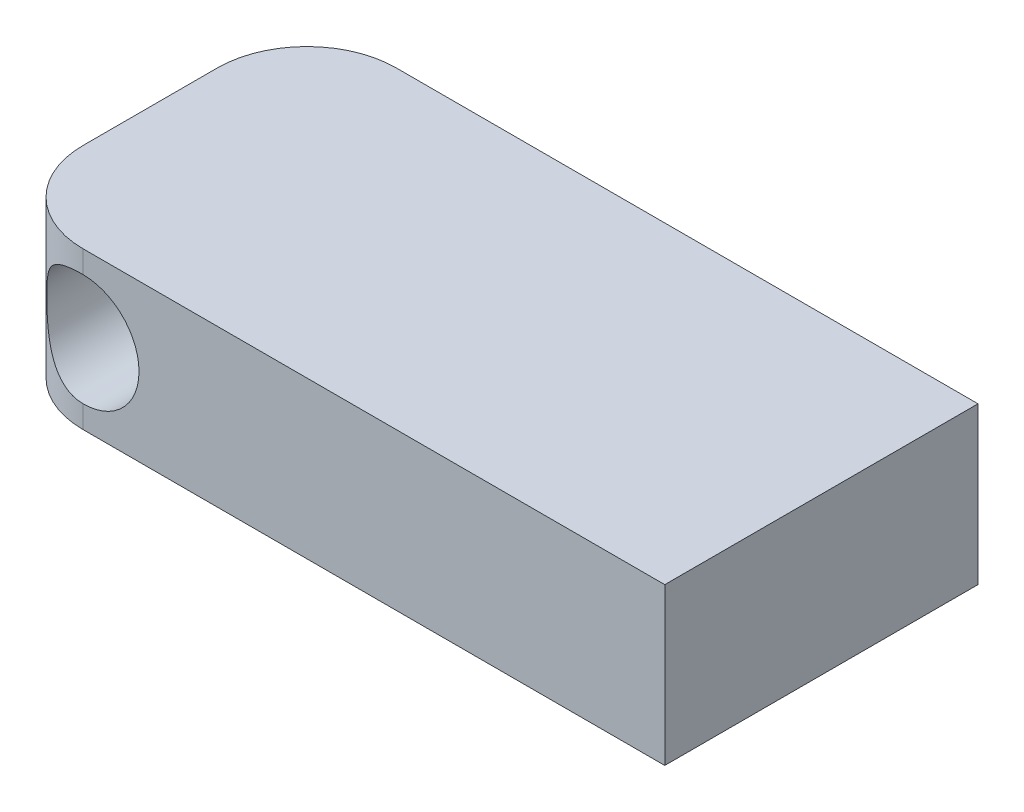
ISO-10303-21;
HEADER;
FILE_DESCRIPTION(('STEP AP214'),'2;1');
FILE_NAME('part.step','',(''),(''),'','','');
FILE_SCHEMA(('AUTOMOTIVE_DESIGN { 1 0 10303 214 1 1 1 1 }'));
ENDSEC;
DATA;
#1=APPLICATION_CONTEXT('core data for automotive mechanical design processes');
#2=APPLICATION_PROTOCOL_DEFINITION('international standard','automotive_design',2000,#1);
#3=PRODUCT_CONTEXT('',#1,'mechanical');
#4=PRODUCT('Part','Part','',(#3));
#5=PRODUCT_RELATED_PRODUCT_CATEGORY('part','',(#4));
#6=PRODUCT_DEFINITION_FORMATION('','',#4);
#7=PRODUCT_DEFINITION_CONTEXT('part definition',#1,'design');
#8=PRODUCT_DEFINITION('design','',#6,#7);
#9=PRODUCT_DEFINITION_SHAPE('','',#8);
#10=(LENGTH_UNIT() NAMED_UNIT(*) SI_UNIT(.MILLI.,.METRE.));
#11=(NAMED_UNIT(*) PLANE_ANGLE_UNIT() SI_UNIT($,.RADIAN.));
#12=(NAMED_UNIT(*) SI_UNIT($,.STERADIAN.) SOLID_ANGLE_UNIT());
#13=UNCERTAINTY_MEASURE_WITH_UNIT(LENGTH_MEASURE(1.E-05),#10,'distance_accuracy_value','');
#14=(GEOMETRIC_REPRESENTATION_CONTEXT(3) GLOBAL_UNCERTAINTY_ASSIGNED_CONTEXT((#13)) GLOBAL_UNIT_ASSIGNED_CONTEXT((#10,
#11,#12)) REPRESENTATION_CONTEXT('',''));
#15=CARTESIAN_POINT('',(0.,0.,0.));
#16=DIRECTION('',(0.,0.,1.));
#17=DIRECTION('',(1.,0.,0.));
#18=AXIS2_PLACEMENT_3D('',#15,#16,#17);
#19=CARTESIAN_POINT('',(23.2516703786192,7.,-10.673719376392));
#20=DIRECTION('',(-1.,0.,0.));
#21=DIRECTION('',(0.,0.,1.));
#22=AXIS2_PLACEMENT_3D('',#19,#20,#21);
#23=PLANE('',#22);
#24=DIRECTION('',(0.,0.,-1.));
#25=VECTOR('',#24,1.);
#26=CARTESIAN_POINT('',(23.2516703786192,0.,-10.673719376392));
#27=LINE('',#26,#25);
#28=CARTESIAN_POINT('',(23.2516703786192,0.,3.32628062360802));
#29=VERTEX_POINT('',#28);
#30=CARTESIAN_POINT('',(23.2516703786192,0.,-10.673719376392));
#31=VERTEX_POINT('',#30);
#32=EDGE_CURVE('E106',#29,#31,#27,.T.);
#33=ORIENTED_EDGE('',*,*,#32,.T.);
#34=DIRECTION('',(0.,-1.,0.));
#35=VECTOR('',#34,1.);
#36=CARTESIAN_POINT('',(23.2516703786192,7.,-10.673719376392));
#37=LINE('',#36,#35);
#38=CARTESIAN_POINT('',(23.2516703786192,7.,-10.673719376392));
#39=VERTEX_POINT('',#38);
#40=EDGE_CURVE('E48',#39,#31,#37,.T.);
#41=ORIENTED_EDGE('',*,*,#40,.F.);
#42=DIRECTION('',(0.,0.,-1.));
#43=VECTOR('',#42,1.);
#44=CARTESIAN_POINT('',(23.2516703786192,7.,-10.673719376392));
#45=LINE('',#44,#43);
#46=CARTESIAN_POINT('',(23.2516703786192,7.,3.32628062360802));
#47=VERTEX_POINT('',#46);
#48=EDGE_CURVE('E138',#47,#39,#45,.T.);
#49=ORIENTED_EDGE('',*,*,#48,.F.);
#50=DIRECTION('',(0.,-1.,0.));
#51=VECTOR('',#50,1.);
#52=CARTESIAN_POINT('',(23.2516703786192,7.,3.32628062360802));
#53=LINE('',#52,#51);
#54=EDGE_CURVE('E132',#47,#29,#53,.T.);
#55=ORIENTED_EDGE('',*,*,#54,.T.);
#56=EDGE_LOOP('',(#33,#41,#49,#55));
#57=FACE_BOUND('',#56,.T.);
#58=ADVANCED_FACE('F41',(#57),#23,.F.);
#59=CARTESIAN_POINT('',(-2.74832962138081,7.,-10.673719376392));
#60=DIRECTION('',(0.,0.,1.));
#61=DIRECTION('',(1.,0.,0.));
#62=AXIS2_PLACEMENT_3D('',#59,#60,#61);
#63=PLANE('',#62);
#64=DIRECTION('',(0.,-1.,0.));
#65=VECTOR('',#64,1.);
#66=CARTESIAN_POINT('',(-2.74832962138081,7.,-10.673719376392));
#67=LINE('',#66,#65);
#68=CARTESIAN_POINT('',(-2.74832962138081,1.,-10.673719376392));
#69=VERTEX_POINT('',#68);
#70=CARTESIAN_POINT('',(-2.74832962138081,0.,-10.673719376392));
#71=VERTEX_POINT('',#70);
#72=EDGE_CURVE('E114',#69,#71,#67,.T.);
#73=ORIENTED_EDGE('',*,*,#72,.F.);
#74=CARTESIAN_POINT('',(-2.74832962138084,3.5,-10.673719376392));
#75=DIRECTION('',(0.,0.,1.));
#76=DIRECTION('',(1.,0.,0.));
#77=AXIS2_PLACEMENT_3D('',#74,#75,#76);
#78=CIRCLE('',#77,2.5);
#79=CARTESIAN_POINT('',(-2.74832962138084,6.,-10.673719376392));
#80=VERTEX_POINT('',#79);
#81=EDGE_CURVE('E54',#69,#80,#78,.T.);
#82=ORIENTED_EDGE('',*,*,#81,.T.);
#83=CARTESIAN_POINT('',(-2.74832962138081,7.,-10.673719376392));
#84=VERTEX_POINT('',#83);
#85=EDGE_CURVE('E111',#84,#80,#67,.T.);
#86=ORIENTED_EDGE('',*,*,#85,.F.);
#87=DIRECTION('',(-1.,0.,0.));
#88=VECTOR('',#87,1.);
#89=CARTESIAN_POINT('',(-2.74832962138081,7.,-10.673719376392));
#90=LINE('',#89,#88);
#91=EDGE_CURVE('E156',#39,#84,#90,.T.);
#92=ORIENTED_EDGE('',*,*,#91,.F.);
#93=ORIENTED_EDGE('',*,*,#40,.T.);
#94=DIRECTION('',(-1.,0.,0.));
#95=VECTOR('',#94,1.);
#96=CARTESIAN_POINT('',(-2.74832962138081,0.,-10.673719376392));
#97=LINE('',#96,#95);
#98=EDGE_CURVE('E146',#31,#71,#97,.T.);
#99=ORIENTED_EDGE('',*,*,#98,.T.);
#100=EDGE_LOOP('',(#73,#82,#86,#92,#93,#99));
#101=FACE_BOUND('',#100,.T.);
#102=ADVANCED_FACE('F110',(#101),#63,.F.);
#103=CARTESIAN_POINT('',(-2.74832962138084,7.,-6.67371937639198));
#104=DIRECTION('',(0.,-1.,0.));
#105=DIRECTION('',(0.,0.,-1.));
#106=AXIS2_PLACEMENT_3D('',#103,#104,#105);
#107=CYLINDRICAL_SURFACE('',#106,4.);
#108=ORIENTED_EDGE('',*,*,#85,.T.);
#109=CARTESIAN_POINT('',(-2.74832962138081,6.,-10.673719376392));
#110=CARTESIAN_POINT('',(-2.81215616438771,6.00001193618333,-10.6737325266695));
#111=CARTESIAN_POINT('',(-2.87597380849803,5.99755608708201,-10.6721920716078));
#112=CARTESIAN_POINT('',(-3.00306058740625,5.987801398607,-10.6661032856263));
#113=CARTESIAN_POINT('',(-3.06632999446491,5.98050512144039,-10.6615565460419));
#114=CARTESIAN_POINT('',(-3.19149773689584,5.96121751654629,-10.649588793268));
#115=CARTESIAN_POINT('',(-3.25340185922103,5.94925339049211,-10.6421844353709));
#116=CARTESIAN_POINT('',(-3.37576098365714,5.92080159859024,-10.624688362661));
#117=CARTESIAN_POINT('',(-3.43621585780608,5.90431353488753,-10.6145964114917));
#118=CARTESIAN_POINT('',(-3.61458884161318,5.84841800722247,-10.5806588028481));
#119=CARTESIAN_POINT('',(-3.72984995317331,5.80252635783875,-10.5531175864126));
#120=CARTESIAN_POINT('',(-3.95072784567378,5.69530643892146,-10.4904565525313));
#121=CARTESIAN_POINT('',(-4.05633259478085,5.6339592596032,-10.4553274589105));
#122=CARTESIAN_POINT('',(-4.26428064945153,5.49222239236169,-10.3771198581763));
#123=CARTESIAN_POINT('',(-4.36570284068101,5.41070916582964,-10.3336320634645));
#124=CARTESIAN_POINT('',(-4.55431731930024,5.23354660044444,-10.2443391791966));
#125=CARTESIAN_POINT('',(-4.64149237740627,5.13788040855507,-10.1985313703851));
#126=CARTESIAN_POINT('',(-4.81118725643924,4.91993146280174,-10.1023274197179));
#127=CARTESIAN_POINT('',(-4.89147481156108,4.79579859748435,-10.0521508576317));
#128=CARTESIAN_POINT('',(-5.02980994639252,4.53286825752305,-9.96032270044337));
#129=CARTESIAN_POINT('',(-5.08789541037118,4.39409628325968,-9.91865664064469));
#130=CARTESIAN_POINT('',(-5.1669973891138,4.1423796629288,-9.85991105543195));
#131=CARTESIAN_POINT('',(-5.19372031221699,4.0320678173147,-9.83925776735614));
#132=CARTESIAN_POINT('',(-5.23196634577281,3.80738965242588,-9.80934664596044));
#133=CARTESIAN_POINT('',(-5.24351072403576,3.69302923729547,-9.80007286916354));
#134=CARTESIAN_POINT('',(-5.25070799626674,3.46317366668974,-9.79431708411918));
#135=CARTESIAN_POINT('',(-5.24631927975732,3.34767632672178,-9.79786856988303));
#136=CARTESIAN_POINT('',(-5.22185585075031,3.11937920258982,-9.81726750735257));
#137=CARTESIAN_POINT('',(-5.20176864742616,3.00658164024958,-9.83312475031863));
#138=CARTESIAN_POINT('',(-5.14769185627454,2.78912366700725,-9.87437072782723));
#139=CARTESIAN_POINT('',(-5.11403041064232,2.68433621941326,-9.89953339893226));
#140=CARTESIAN_POINT('',(-5.03413380209773,2.48167863190364,-9.95663038554824));
#141=CARTESIAN_POINT('',(-4.98789406058135,2.38381102724441,-9.98856716595697));
#142=CARTESIAN_POINT('',(-4.87422568587136,2.17832953618365,-10.0628170926304));
#143=CARTESIAN_POINT('',(-4.80445229749752,2.07231123152263,-10.105954066368));
#144=CARTESIAN_POINT('',(-4.65008455739749,1.87233202460499,-10.1938371543413));
#145=CARTESIAN_POINT('',(-4.56547604044272,1.77838279633567,-10.2385847737431));
#146=CARTESIAN_POINT('',(-4.36740140127637,1.58942225498138,-10.3333043958373));
#147=CARTESIAN_POINT('',(-4.25147746324939,1.49678651554121,-10.3829223820519));
#148=CARTESIAN_POINT('',(-4.00265474179945,1.3323211515836,-10.4742662235958));
#149=CARTESIAN_POINT('',(-3.86975489045424,1.26049283695123,-10.515991582005));
#150=CARTESIAN_POINT('',(-3.66402986056328,1.1726216154961,-10.5680983816369));
#151=CARTESIAN_POINT('',(-3.59636899519356,1.14710711609094,-10.5834233580841));
#152=CARTESIAN_POINT('',(-3.45850426988162,1.10189624375364,-10.6107962046838));
#153=CARTESIAN_POINT('',(-3.38830200069301,1.08219629963375,-10.6228460859751));
#154=CARTESIAN_POINT('',(-3.24613936649717,1.04897921623229,-10.6432700722123));
#155=CARTESIAN_POINT('',(-3.17418439038757,1.03544515743576,-10.6516542335044));
#156=CARTESIAN_POINT('',(-3.02906246802503,1.01473323403824,-10.6645192970359));
#157=CARTESIAN_POINT('',(-2.95589669713717,1.00754953578481,-10.6690037815861));
#158=CARTESIAN_POINT('',(-2.86017682319852,1.00240259785252,-10.6722181717414));
#159=CARTESIAN_POINT('',(-2.83780813425928,1.00150134005561,-10.6727812070418));
#160=CARTESIAN_POINT('',(-2.79307064490186,1.00030047279548,-10.6735315363988));
#161=CARTESIAN_POINT('',(-2.77070186684317,1.00000026420145,-10.6737192046241));
#162=CARTESIAN_POINT('',(-2.74832962138081,1.,-10.673719376392));
#163=B_SPLINE_CURVE_WITH_KNOTS('',3,(#109,#110,#111,#112,#113,#114,#115,#116,#117,#118,#119,
#120,#121,#122,#123,#124,#125,#126,#127,#128,#129,#130,#131,#132,#133,#134,#135,#136,#137,#138,
#139,#140,#141,#142,#143,#144,#145,#146,#147,#148,#149,#150,#151,#152,#153,#154,#155,#156,#157,
#158,#159,#160,#161,#162),.UNSPECIFIED.,.F.,.F.,(4,2,2,2,2,2,2,2,2,2,2,2,2,2,2,2,2,2,2,2,2,2,2,
2,2,2,4),(0.,0.191399175832532,0.382697118170853,0.572896542435407,0.763112699040341,
1.14253664794783,1.52242709447157,1.93241222665571,2.34288954923404,2.80899997842291,
3.27431147694232,3.61897490282399,3.96315487815412,4.30823435125186,4.65358867387747,
4.99105200609771,5.3286383425281,5.72930055148219,6.13034743453749,6.59747389227273,
7.06462975052634,7.28610034871989,7.50743463953598,7.72815786405857,7.94867811354226,
8.01585211889171,8.082959131232),.UNSPECIFIED.);
#164=EDGE_CURVE('E101',#80,#69,#163,.T.);
#165=ORIENTED_EDGE('',*,*,#164,.T.);
#166=ORIENTED_EDGE('',*,*,#72,.T.);
#167=CARTESIAN_POINT('',(-2.74832962138084,0.,-6.67371937639198));
#168=DIRECTION('',(0.,1.,0.));
#169=DIRECTION('',(0.,0.,1.));
#170=AXIS2_PLACEMENT_3D('',#167,#168,#169);
#171=CIRCLE('',#170,4.);
#172=CARTESIAN_POINT('',(-6.74832962138084,0.,-6.67371937639195));
#173=VERTEX_POINT('',#172);
#174=EDGE_CURVE('E144',#71,#173,#171,.T.);
#175=ORIENTED_EDGE('',*,*,#174,.T.);
#176=DIRECTION('',(0.,-1.,0.));
#177=VECTOR('',#176,1.);
#178=CARTESIAN_POINT('',(-6.74832962138084,7.,-6.67371937639195));
#179=LINE('',#178,#177);
#180=CARTESIAN_POINT('',(-6.74832962138084,7.,-6.67371937639195));
#181=VERTEX_POINT('',#180);
#182=EDGE_CURVE('E121',#181,#173,#179,.T.);
#183=ORIENTED_EDGE('',*,*,#182,.F.);
#184=CARTESIAN_POINT('',(-2.74832962138084,7.,-6.67371937639198));
#185=DIRECTION('',(0.,1.,0.));
#186=DIRECTION('',(0.,0.,1.));
#187=AXIS2_PLACEMENT_3D('',#184,#185,#186);
#188=CIRCLE('',#187,4.);
#189=EDGE_CURVE('E118',#84,#181,#188,.T.);
#190=ORIENTED_EDGE('',*,*,#189,.F.);
#191=EDGE_LOOP('',(#108,#165,#166,#175,#183,#190));
#192=FACE_BOUND('',#191,.T.);
#193=ADVANCED_FACE('F116',(#192),#107,.T.);
#194=CARTESIAN_POINT('',(-6.74832962138084,7.,-6.67371937639195));
#195=DIRECTION('',(1.,0.,0.));
#196=DIRECTION('',(0.,0.,-1.));
#197=AXIS2_PLACEMENT_3D('',#194,#195,#196);
#198=PLANE('',#197);
#199=DIRECTION('',(0.,0.,1.));
#200=VECTOR('',#199,1.);
#201=CARTESIAN_POINT('',(-6.74832962138084,0.,-6.67371937639195));
#202=LINE('',#201,#200);
#203=CARTESIAN_POINT('',(-6.74832962138084,0.,-0.673719376392011));
#204=VERTEX_POINT('',#203);
#205=EDGE_CURVE('E142',#173,#204,#202,.T.);
#206=ORIENTED_EDGE('',*,*,#205,.T.);
#207=DIRECTION('',(0.,-1.,0.));
#208=VECTOR('',#207,1.);
#209=CARTESIAN_POINT('',(-6.74832962138084,7.,-0.673719376392011));
#210=LINE('',#209,#208);
#211=CARTESIAN_POINT('',(-6.74832962138084,7.,-0.673719376392011));
#212=VERTEX_POINT('',#211);
#213=EDGE_CURVE('E125',#212,#204,#210,.T.);
#214=ORIENTED_EDGE('',*,*,#213,.F.);
#215=DIRECTION('',(0.,0.,1.));
#216=VECTOR('',#215,1.);
#217=CARTESIAN_POINT('',(-6.74832962138084,7.,-6.67371937639195));
#218=LINE('',#217,#216);
#219=EDGE_CURVE('E153',#181,#212,#218,.T.);
#220=ORIENTED_EDGE('',*,*,#219,.F.);
#221=ORIENTED_EDGE('',*,*,#182,.T.);
#222=EDGE_LOOP('',(#206,#214,#220,#221));
#223=FACE_BOUND('',#222,.T.);
#224=ADVANCED_FACE('F191',(#223),#198,.F.);
#225=CARTESIAN_POINT('',(-2.74832962138084,7.,-0.673719376391982));
#226=DIRECTION('',(0.,-1.,0.));
#227=DIRECTION('',(0.,0.,-1.));
#228=AXIS2_PLACEMENT_3D('',#225,#226,#227);
#229=CYLINDRICAL_SURFACE('',#228,4.);
#230=DIRECTION('',(0.,-1.,0.));
#231=VECTOR('',#230,1.);
#232=CARTESIAN_POINT('',(-2.74832962138081,7.,3.32628062360802));
#233=LINE('',#232,#231);
#234=CARTESIAN_POINT('',(-2.74832962138081,1.,3.32628062360802));
#235=VERTEX_POINT('',#234);
#236=CARTESIAN_POINT('',(-2.74832962138081,0.,3.32628062360802));
#237=VERTEX_POINT('',#236);
#238=EDGE_CURVE('E131',#235,#237,#233,.T.);
#239=ORIENTED_EDGE('',*,*,#238,.F.);
#240=CARTESIAN_POINT('',(-2.74832962138081,1.,3.32628062360802));
#241=CARTESIAN_POINT('',(-2.81215616438771,0.999988063816666,3.32629377388558));
#242=CARTESIAN_POINT('',(-2.87597380849802,1.00244391291799,3.32475331882379));
#243=CARTESIAN_POINT('',(-3.00306058740625,1.012198601393,3.31866453284233));
#244=CARTESIAN_POINT('',(-3.06632999446491,1.01949487855961,3.31411779325797));
#245=CARTESIAN_POINT('',(-3.19149773689584,1.03878248345371,3.30215004048409));
#246=CARTESIAN_POINT('',(-3.25340185922103,1.05074660950789,3.29474568258693));
#247=CARTESIAN_POINT('',(-3.37576098365714,1.07919840140976,3.27724960987703));
#248=CARTESIAN_POINT('',(-3.43621585780608,1.09568646511247,3.26715765870778));
#249=CARTESIAN_POINT('',(-3.61458884161318,1.15158199277753,3.23322005006413));
#250=CARTESIAN_POINT('',(-3.72984995317331,1.19747364216125,3.20567883362861));
#251=CARTESIAN_POINT('',(-3.95072784567378,1.30469356107854,3.14301779974729));
#252=CARTESIAN_POINT('',(-4.05633259478085,1.3660407403968,3.10788870612651));
#253=CARTESIAN_POINT('',(-4.26428064945153,1.50777760763831,3.02968110539233));
#254=CARTESIAN_POINT('',(-4.36570284068101,1.58929083417036,2.98619331068057));
#255=CARTESIAN_POINT('',(-4.55431731930024,1.76645339955556,2.89690042641263));
#256=CARTESIAN_POINT('',(-4.64149237740627,1.86211959144493,2.85109261760111));
#257=CARTESIAN_POINT('',(-4.81118725643924,2.08006853719826,2.75488866693397));
#258=CARTESIAN_POINT('',(-4.89147481156108,2.20420140251565,2.70471210484772));
#259=CARTESIAN_POINT('',(-5.02980994639252,2.46713174247695,2.61288394765941));
#260=CARTESIAN_POINT('',(-5.08789541037118,2.60590371674032,2.57121788786073));
#261=CARTESIAN_POINT('',(-5.1669973891138,2.8576203370712,2.51247230264799));
#262=CARTESIAN_POINT('',(-5.19372031221699,2.9679321826853,2.49181901457218));
#263=CARTESIAN_POINT('',(-5.23196634577281,3.19261034757412,2.46190789317648));
#264=CARTESIAN_POINT('',(-5.24351072403576,3.30697076270453,2.45263411637958));
#265=CARTESIAN_POINT('',(-5.25070799626674,3.53682633331026,2.44687833133521));
#266=CARTESIAN_POINT('',(-5.24631927975732,3.65232367327822,2.45042981709907));
#267=CARTESIAN_POINT('',(-5.22185585075031,3.88062079741018,2.46982875456861));
#268=CARTESIAN_POINT('',(-5.20176864742616,3.99341835975042,2.48568599753466));
#269=CARTESIAN_POINT('',(-5.14769185627454,4.21087633299275,2.52693197504327));
#270=CARTESIAN_POINT('',(-5.11403041064232,4.31566378058674,2.55209464614829));
#271=CARTESIAN_POINT('',(-5.03413380209773,4.51832136809636,2.60919163276428));
#272=CARTESIAN_POINT('',(-4.98789406058136,4.61618897275559,2.641128413173));
#273=CARTESIAN_POINT('',(-4.87422568587136,4.82167046381635,2.71537833984647));
#274=CARTESIAN_POINT('',(-4.80445229749752,4.92768876847737,2.75851531358408));
#275=CARTESIAN_POINT('',(-4.65008455739749,5.12766797539501,2.84639840155738));
#276=CARTESIAN_POINT('',(-4.56547604044272,5.22161720366433,2.89114602095912));
#277=CARTESIAN_POINT('',(-4.36740140127637,5.41057774501862,2.98586564305333));
#278=CARTESIAN_POINT('',(-4.25147746324939,5.50321348445879,3.0354836292679));
#279=CARTESIAN_POINT('',(-4.00265474179945,5.6676788484164,3.12682747081182));
#280=CARTESIAN_POINT('',(-3.86975489045425,5.73950716304877,3.16855282922102));
#281=CARTESIAN_POINT('',(-3.66402986056328,5.8273783845039,3.22065962885295));
#282=CARTESIAN_POINT('',(-3.59636899519356,5.85289288390906,3.23598460530015));
#283=CARTESIAN_POINT('',(-3.45850426988162,5.89810375624636,3.26335745189984));
#284=CARTESIAN_POINT('',(-3.38830200069301,5.91780370036625,3.27540733319114));
#285=CARTESIAN_POINT('',(-3.24613936649718,5.95102078376771,3.29583131942832));
#286=CARTESIAN_POINT('',(-3.17418439038757,5.96455484256424,3.30421548072047));
#287=CARTESIAN_POINT('',(-3.02906246802503,5.98526676596176,3.31708054425191));
#288=CARTESIAN_POINT('',(-2.95589669713717,5.99245046421519,3.32156502880213));
#289=CARTESIAN_POINT('',(-2.86017682319852,5.99759740214748,3.32477941895745));
#290=CARTESIAN_POINT('',(-2.83780813425928,5.99849865994439,3.32534245425786));
#291=CARTESIAN_POINT('',(-2.79307064490186,5.99969952720452,3.32609278361481));
#292=CARTESIAN_POINT('',(-2.77070186684317,5.99999973579855,3.32628045184015));
#293=CARTESIAN_POINT('',(-2.74832962138081,6.,3.32628062360802));
#294=B_SPLINE_CURVE_WITH_KNOTS('',3,(#240,#241,#242,#243,#244,#245,#246,#247,#248,#249,#250,
#251,#252,#253,#254,#255,#256,#257,#258,#259,#260,#261,#262,#263,#264,#265,#266,#267,#268,#269,
#270,#271,#272,#273,#274,#275,#276,#277,#278,#279,#280,#281,#282,#283,#284,#285,#286,#287,#288,
#289,#290,#291,#292,#293),.UNSPECIFIED.,.F.,.F.,(4,2,2,2,2,2,2,2,2,2,2,2,2,2,2,2,2,2,2,2,2,2,2,
2,2,2,4),(0.,0.191399175832532,0.382697118170853,0.572896542435408,0.763112699040342,
1.14253664794783,1.52242709447157,1.93241222665571,2.34288954923404,2.80899997842291,
3.27431147694232,3.61897490282399,3.96315487815412,4.30823435125186,4.65358867387747,
4.99105200609771,5.3286383425281,5.72930055148219,6.13034743453749,6.59747389227273,
7.06462975052634,7.28610034871989,7.50743463953598,7.72815786405857,7.94867811354226,
8.01585211889171,8.082959131232),.UNSPECIFIED.);
#295=CARTESIAN_POINT('',(-2.74832962138081,6.,3.32628062360802));
#296=VERTEX_POINT('',#295);
#297=EDGE_CURVE('E61',#235,#296,#294,.T.);
#298=ORIENTED_EDGE('',*,*,#297,.T.);
#299=CARTESIAN_POINT('',(-2.74832962138081,7.,3.32628062360802));
#300=VERTEX_POINT('',#299);
#301=EDGE_CURVE('E128',#300,#296,#233,.T.);
#302=ORIENTED_EDGE('',*,*,#301,.F.);
#303=CARTESIAN_POINT('',(-2.74832962138084,7.,-0.673719376391982));
#304=DIRECTION('',(0.,1.,0.));
#305=DIRECTION('',(0.,0.,1.));
#306=AXIS2_PLACEMENT_3D('',#303,#304,#305);
#307=CIRCLE('',#306,4.);
#308=EDGE_CURVE('E151',#212,#300,#307,.T.);
#309=ORIENTED_EDGE('',*,*,#308,.F.);
#310=ORIENTED_EDGE('',*,*,#213,.T.);
#311=CARTESIAN_POINT('',(-2.74832962138084,0.,-0.673719376391982));
#312=DIRECTION('',(0.,1.,0.));
#313=DIRECTION('',(0.,0.,1.));
#314=AXIS2_PLACEMENT_3D('',#311,#312,#313);
#315=CIRCLE('',#314,4.);
#316=EDGE_CURVE('E139',#204,#237,#315,.T.);
#317=ORIENTED_EDGE('',*,*,#316,.T.);
#318=EDGE_LOOP('',(#239,#298,#302,#309,#310,#317));
#319=FACE_BOUND('',#318,.T.);
#320=ADVANCED_FACE('F187',(#319),#229,.T.);
#321=CARTESIAN_POINT('',(-2.74832962138081,7.,3.32628062360802));
#322=DIRECTION('',(0.,0.,-1.));
#323=DIRECTION('',(-1.,0.,0.));
#324=AXIS2_PLACEMENT_3D('',#321,#322,#323);
#325=PLANE('',#324);
#326=ORIENTED_EDGE('',*,*,#301,.T.);
#327=CARTESIAN_POINT('',(-2.74832962138084,3.5,3.32628062360802));
#328=DIRECTION('',(0.,0.,-1.));
#329=DIRECTION('',(-1.,0.,0.));
#330=AXIS2_PLACEMENT_3D('',#327,#328,#329);
#331=CIRCLE('',#330,2.5);
#332=EDGE_CURVE('E12',#296,#235,#331,.T.);
#333=ORIENTED_EDGE('',*,*,#332,.T.);
#334=ORIENTED_EDGE('',*,*,#238,.T.);
#335=DIRECTION('',(1.,0.,0.));
#336=VECTOR('',#335,1.);
#337=CARTESIAN_POINT('',(-2.74832962138081,0.,3.32628062360802));
#338=LINE('',#337,#336);
#339=EDGE_CURVE('E136',#237,#29,#338,.T.);
#340=ORIENTED_EDGE('',*,*,#339,.T.);
#341=ORIENTED_EDGE('',*,*,#54,.F.);
#342=DIRECTION('',(1.,0.,0.));
#343=VECTOR('',#342,1.);
#344=CARTESIAN_POINT('',(-2.74832962138081,7.,3.32628062360802));
#345=LINE('',#344,#343);
#346=EDGE_CURVE('E135',#300,#47,#345,.T.);
#347=ORIENTED_EDGE('',*,*,#346,.F.);
#348=EDGE_LOOP('',(#326,#333,#334,#340,#341,#347));
#349=FACE_BOUND('',#348,.T.);
#350=ADVANCED_FACE('F181',(#349),#325,.F.);
#351=CARTESIAN_POINT('',(-2.74832962138084,7.,-0.673719376391982));
#352=DIRECTION('',(0.,1.,0.));
#353=DIRECTION('',(0.,0.,1.));
#354=AXIS2_PLACEMENT_3D('',#351,#352,#353);
#355=PLANE('',#354);
#356=ORIENTED_EDGE('',*,*,#48,.T.);
#357=ORIENTED_EDGE('',*,*,#91,.T.);
#358=ORIENTED_EDGE('',*,*,#189,.T.);
#359=ORIENTED_EDGE('',*,*,#219,.T.);
#360=ORIENTED_EDGE('',*,*,#308,.T.);
#361=ORIENTED_EDGE('',*,*,#346,.T.);
#362=EDGE_LOOP('',(#356,#357,#358,#359,#360,#361));
#363=FACE_BOUND('',#362,.T.);
#364=ADVANCED_FACE('F177',(#363),#355,.T.);
#365=CARTESIAN_POINT('',(-2.74832962138084,0.,-0.673719376391982));
#366=DIRECTION('',(0.,1.,0.));
#367=DIRECTION('',(0.,0.,1.));
#368=AXIS2_PLACEMENT_3D('',#365,#366,#367);
#369=PLANE('',#368);
#370=ORIENTED_EDGE('',*,*,#32,.F.);
#371=ORIENTED_EDGE('',*,*,#339,.F.);
#372=ORIENTED_EDGE('',*,*,#316,.F.);
#373=ORIENTED_EDGE('',*,*,#205,.F.);
#374=ORIENTED_EDGE('',*,*,#174,.F.);
#375=ORIENTED_EDGE('',*,*,#98,.F.);
#376=EDGE_LOOP('',(#370,#371,#372,#373,#374,#375));
#377=FACE_BOUND('',#376,.T.);
#378=ADVANCED_FACE('F176',(#377),#369,.F.);
#379=CARTESIAN_POINT('',(-2.74832962138084,3.5,-10.673719376392));
#380=DIRECTION('',(0.,0.,1.));
#381=DIRECTION('',(1.,0.,0.));
#382=AXIS2_PLACEMENT_3D('',#379,#380,#381);
#383=CYLINDRICAL_SURFACE('',#382,2.5);
#384=ORIENTED_EDGE('',*,*,#332,.F.);
#385=ORIENTED_EDGE('',*,*,#297,.F.);
#386=EDGE_LOOP('',(#384,#385));
#387=FACE_BOUND('',#386,.T.);
#388=ORIENTED_EDGE('',*,*,#81,.F.);
#389=ORIENTED_EDGE('',*,*,#164,.F.);
#390=EDGE_LOOP('',(#388,#389));
#391=FACE_BOUND('',#390,.T.);
#392=ADVANCED_FACE('F102',(#387,#391),#383,.F.);
#393=CLOSED_SHELL('',(#58,#102,#193,#224,#320,#350,#364,#378,#392));
#394=MANIFOLD_SOLID_BREP('B2',#393);
#395=ADVANCED_BREP_SHAPE_REPRESENTATION('',(#18,#394),#14);
#396=SHAPE_DEFINITION_REPRESENTATION(#9,#395);
ENDSEC;
END-ISO-10303-21;
